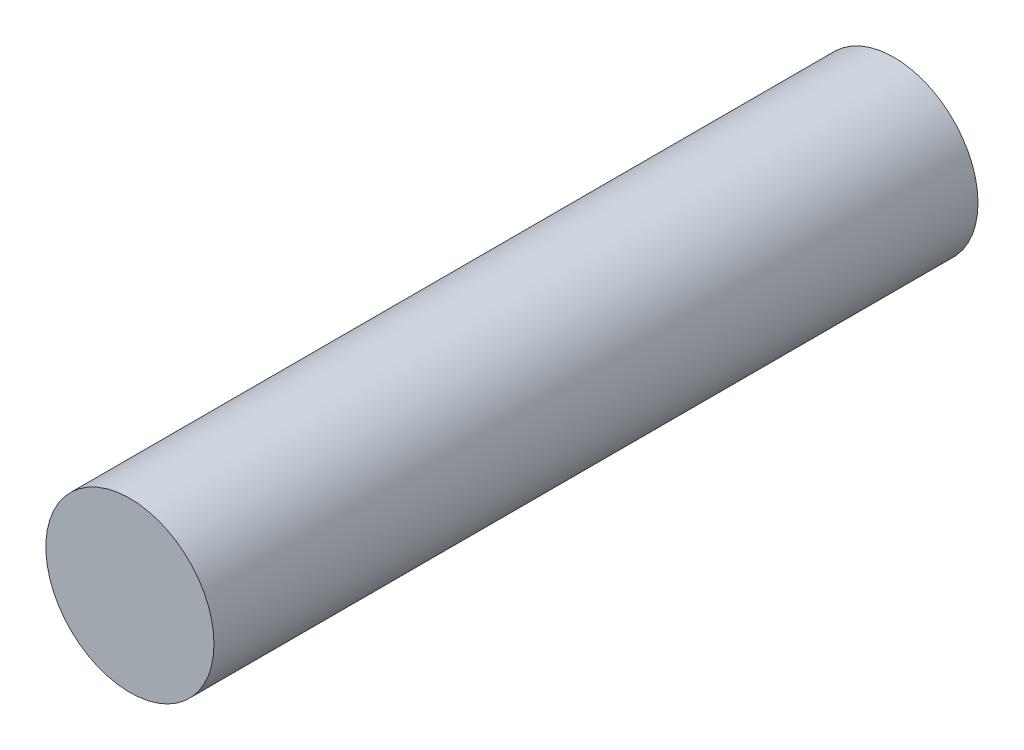
ISO-10303-21;
HEADER;
FILE_DESCRIPTION(('STEP AP214'),'2;1');
FILE_NAME('part.step','',(''),(''),'','','');
FILE_SCHEMA(('AUTOMOTIVE_DESIGN { 1 0 10303 214 1 1 1 1 }'));
ENDSEC;
DATA;
#1=APPLICATION_CONTEXT('core data for automotive mechanical design processes');
#2=APPLICATION_PROTOCOL_DEFINITION('international standard','automotive_design',2000,#1);
#3=PRODUCT_CONTEXT('',#1,'mechanical');
#4=PRODUCT('Part','Part','',(#3));
#5=PRODUCT_RELATED_PRODUCT_CATEGORY('part','',(#4));
#6=PRODUCT_DEFINITION_FORMATION('','',#4);
#7=PRODUCT_DEFINITION_CONTEXT('part definition',#1,'design');
#8=PRODUCT_DEFINITION('design','',#6,#7);
#9=PRODUCT_DEFINITION_SHAPE('','',#8);
#10=(LENGTH_UNIT() NAMED_UNIT(*) SI_UNIT(.MILLI.,.METRE.));
#11=(NAMED_UNIT(*) PLANE_ANGLE_UNIT() SI_UNIT($,.RADIAN.));
#12=(NAMED_UNIT(*) SI_UNIT($,.STERADIAN.) SOLID_ANGLE_UNIT());
#13=UNCERTAINTY_MEASURE_WITH_UNIT(LENGTH_MEASURE(1.E-05),#10,'distance_accuracy_value','');
#14=(GEOMETRIC_REPRESENTATION_CONTEXT(3) GLOBAL_UNCERTAINTY_ASSIGNED_CONTEXT((#13)) GLOBAL_UNIT_ASSIGNED_CONTEXT((#10,
#11,#12)) REPRESENTATION_CONTEXT('',''));
#15=CARTESIAN_POINT('',(0.,0.,0.));
#16=DIRECTION('',(0.,0.,1.));
#17=DIRECTION('',(1.,0.,0.));
#18=AXIS2_PLACEMENT_3D('',#15,#16,#17);
#19=CARTESIAN_POINT('',(0.,0.,-94.5866403026729));
#20=DIRECTION('',(0.,0.,1.));
#21=DIRECTION('',(1.,0.,0.));
#22=AXIS2_PLACEMENT_3D('',#19,#20,#21);
#23=CYLINDRICAL_SURFACE('',#22,7.9375);
#24=CARTESIAN_POINT('',(0.,0.,-72.136));
#25=DIRECTION('',(0.,0.,1.));
#26=DIRECTION('',(1.,0.,0.));
#27=AXIS2_PLACEMENT_3D('',#24,#25,#26);
#28=CIRCLE('',#27,7.9375);
#29=CARTESIAN_POINT('',(7.9375,0.,-72.136));
#30=VERTEX_POINT('',#29);
#31=EDGE_CURVE('E10',#30,#30,#28,.F.);
#32=ORIENTED_EDGE('',*,*,#31,.F.);
#33=EDGE_LOOP('',(#32));
#34=FACE_BOUND('',#33,.T.);
#35=CARTESIAN_POINT('',(0.,0.,0.));
#36=DIRECTION('',(0.,0.,1.));
#37=DIRECTION('',(1.,0.,0.));
#38=AXIS2_PLACEMENT_3D('',#35,#36,#37);
#39=CIRCLE('',#38,7.9375);
#40=CARTESIAN_POINT('',(7.9375,0.,0.));
#41=VERTEX_POINT('',#40);
#42=EDGE_CURVE('E42',#41,#41,#39,.T.);
#43=ORIENTED_EDGE('',*,*,#42,.F.);
#44=EDGE_LOOP('',(#43));
#45=FACE_BOUND('',#44,.T.);
#46=ADVANCED_FACE('F36',(#34,#45),#23,.T.);
#47=CARTESIAN_POINT('',(0.,0.,0.));
#48=DIRECTION('',(0.,0.,1.));
#49=DIRECTION('',(1.,0.,0.));
#50=AXIS2_PLACEMENT_3D('',#47,#48,#49);
#51=PLANE('',#50);
#52=ORIENTED_EDGE('',*,*,#42,.T.);
#53=EDGE_LOOP('',(#52));
#54=FACE_BOUND('',#53,.T.);
#55=ADVANCED_FACE('F48',(#54),#51,.T.);
#56=CARTESIAN_POINT('',(0.,0.,-72.136));
#57=DIRECTION('',(0.,0.,1.));
#58=DIRECTION('',(1.,0.,0.));
#59=AXIS2_PLACEMENT_3D('',#56,#57,#58);
#60=PLANE('',#59);
#61=ORIENTED_EDGE('',*,*,#31,.T.);
#62=EDGE_LOOP('',(#61));
#63=FACE_BOUND('',#62,.T.);
#64=ADVANCED_FACE('F55',(#63),#60,.F.);
#65=CLOSED_SHELL('',(#46,#55,#64));
#66=MANIFOLD_SOLID_BREP('B2',#65);
#67=ADVANCED_BREP_SHAPE_REPRESENTATION('',(#18,#66),#14);
#68=SHAPE_DEFINITION_REPRESENTATION(#9,#67);
ENDSEC;
END-ISO-10303-21;
